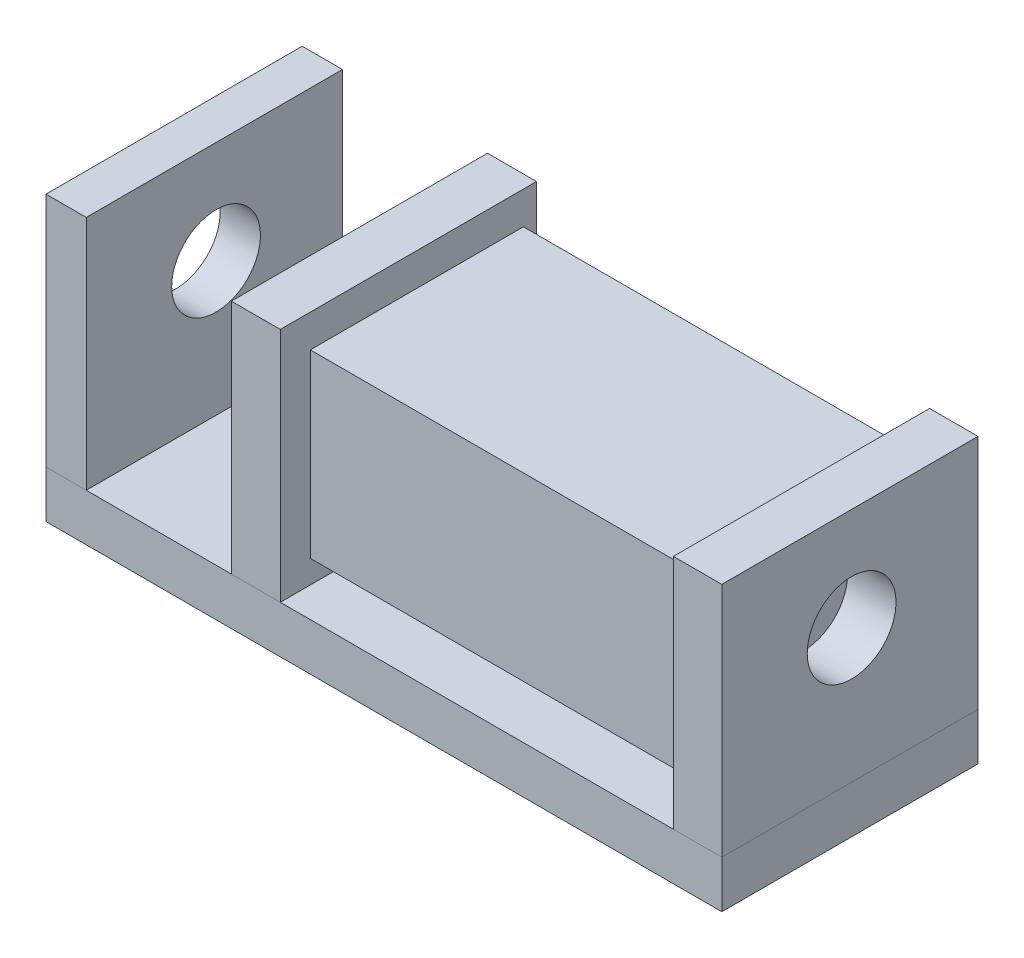
ISO-10303-21;
HEADER;
FILE_DESCRIPTION(('STEP AP214'),'2;1');
FILE_NAME('part.step','',(''),(''),'','','');
FILE_SCHEMA(('AUTOMOTIVE_DESIGN { 1 0 10303 214 1 1 1 1 }'));
ENDSEC;
DATA;
#1=APPLICATION_CONTEXT('core data for automotive mechanical design processes');
#2=APPLICATION_PROTOCOL_DEFINITION('international standard','automotive_design',2000,#1);
#3=PRODUCT_CONTEXT('',#1,'mechanical');
#4=PRODUCT('Part','Part','',(#3));
#5=PRODUCT_RELATED_PRODUCT_CATEGORY('part','',(#4));
#6=PRODUCT_DEFINITION_FORMATION('','',#4);
#7=PRODUCT_DEFINITION_CONTEXT('part definition',#1,'design');
#8=PRODUCT_DEFINITION('design','',#6,#7);
#9=PRODUCT_DEFINITION_SHAPE('','',#8);
#10=(LENGTH_UNIT() NAMED_UNIT(*) SI_UNIT(.MILLI.,.METRE.));
#11=(NAMED_UNIT(*) PLANE_ANGLE_UNIT() SI_UNIT($,.RADIAN.));
#12=(NAMED_UNIT(*) SI_UNIT($,.STERADIAN.) SOLID_ANGLE_UNIT());
#13=UNCERTAINTY_MEASURE_WITH_UNIT(LENGTH_MEASURE(1.E-05),#10,'distance_accuracy_value','');
#14=(GEOMETRIC_REPRESENTATION_CONTEXT(3) GLOBAL_UNCERTAINTY_ASSIGNED_CONTEXT((#13)) GLOBAL_UNIT_ASSIGNED_CONTEXT((#10,
#11,#12)) REPRESENTATION_CONTEXT('',''));
#15=CARTESIAN_POINT('',(0.,0.,0.));
#16=DIRECTION('',(0.,0.,1.));
#17=DIRECTION('',(1.,0.,0.));
#18=AXIS2_PLACEMENT_3D('',#15,#16,#17);
#19=CARTESIAN_POINT('',(132.746933466122,60.,0.));
#20=DIRECTION('',(1.,0.,0.));
#21=DIRECTION('',(0.,0.,-1.));
#22=AXIS2_PLACEMENT_3D('',#19,#20,#21);
#23=PLANE('',#22);
#24=DIRECTION('',(0.,-1.,0.));
#25=VECTOR('',#24,1.);
#26=CARTESIAN_POINT('',(132.746933466137,53.0819568307948,-6.34781427334019));
#27=LINE('',#26,#25);
#28=CARTESIAN_POINT('',(132.746933466137,53.0819568307948,-6.34781427334019));
#29=VERTEX_POINT('',#28);
#30=CARTESIAN_POINT('',(132.746933466137,14.8769483537876,-6.34781427334019));
#31=VERTEX_POINT('',#30);
#32=EDGE_CURVE('E49',#29,#31,#27,.T.);
#33=ORIENTED_EDGE('',*,*,#32,.T.);
#34=DIRECTION('',(0.,0.,-1.));
#35=VECTOR('',#34,1.);
#36=CARTESIAN_POINT('',(132.746933466137,14.8769483537876,-6.34781427334019));
#37=LINE('',#36,#35);
#38=CARTESIAN_POINT('',(132.746933466137,14.8769483537876,-51.4371231705013));
#39=VERTEX_POINT('',#38);
#40=EDGE_CURVE('E114',#31,#39,#37,.T.);
#41=ORIENTED_EDGE('',*,*,#40,.T.);
#42=DIRECTION('',(0.,1.,0.));
#43=VECTOR('',#42,1.);
#44=CARTESIAN_POINT('',(132.746933466137,53.0819568307948,-51.4371231705013));
#45=LINE('',#44,#43);
#46=CARTESIAN_POINT('',(132.746933466137,53.0819568307948,-51.4371231705013));
#47=VERTEX_POINT('',#46);
#48=EDGE_CURVE('E54',#39,#47,#45,.T.);
#49=ORIENTED_EDGE('',*,*,#48,.T.);
#50=DIRECTION('',(0.,0.,1.));
#51=VECTOR('',#50,1.);
#52=CARTESIAN_POINT('',(132.746933466137,53.0819568307948,-6.34781427334019));
#53=LINE('',#52,#51);
#54=EDGE_CURVE('E12',#47,#29,#53,.T.);
#55=ORIENTED_EDGE('',*,*,#54,.T.);
#56=EDGE_LOOP('',(#33,#41,#49,#55));
#57=FACE_BOUND('',#56,.T.);
#58=ADVANCED_FACE('F46',(#57),#23,.T.);
#59=CARTESIAN_POINT('',(500000.,14.8769483537876,-6.34781427334019));
#60=DIRECTION('',(0.,1.,0.));
#61=DIRECTION('',(0.,0.,1.));
#62=AXIS2_PLACEMENT_3D('',#59,#60,#61);
#63=PLANE('',#62);
#64=ORIENTED_EDGE('',*,*,#40,.F.);
#65=DIRECTION('',(-1.,0.,0.));
#66=VECTOR('',#65,1.);
#67=CARTESIAN_POINT('',(500000.,14.8769483537876,-6.34781427334019));
#68=LINE('',#67,#66);
#69=CARTESIAN_POINT('',(49.5738244185297,14.8769483537876,-6.34781427334019));
#70=VERTEX_POINT('',#69);
#71=EDGE_CURVE('E109',#31,#70,#68,.T.);
#72=ORIENTED_EDGE('',*,*,#71,.T.);
#73=DIRECTION('',(0.,0.,-1.));
#74=VECTOR('',#73,1.);
#75=CARTESIAN_POINT('',(49.5738244185297,14.8769483537876,-6.34781427334019));
#76=LINE('',#75,#74);
#77=CARTESIAN_POINT('',(49.5738244185297,14.8769483537876,-51.4371231705013));
#78=VERTEX_POINT('',#77);
#79=EDGE_CURVE('E104',#70,#78,#76,.T.);
#80=ORIENTED_EDGE('',*,*,#79,.T.);
#81=DIRECTION('',(-1.,0.,0.));
#82=VECTOR('',#81,1.);
#83=CARTESIAN_POINT('',(500000.,14.8769483537876,-51.4371231705013));
#84=LINE('',#83,#82);
#85=EDGE_CURVE('E111',#39,#78,#84,.T.);
#86=ORIENTED_EDGE('',*,*,#85,.F.);
#87=EDGE_LOOP('',(#64,#72,#80,#86));
#88=FACE_BOUND('',#87,.T.);
#89=ADVANCED_FACE('F118',(#88),#63,.F.);
#90=CARTESIAN_POINT('',(500000.,53.0819568307948,-6.34781427334019));
#91=DIRECTION('',(0.,0.,-1.));
#92=DIRECTION('',(-1.,0.,0.));
#93=AXIS2_PLACEMENT_3D('',#90,#91,#92);
#94=PLANE('',#93);
#95=ORIENTED_EDGE('',*,*,#32,.F.);
#96=DIRECTION('',(-1.,0.,0.));
#97=VECTOR('',#96,1.);
#98=CARTESIAN_POINT('',(500000.,53.0819568307948,-6.34781427334019));
#99=LINE('',#98,#97);
#100=CARTESIAN_POINT('',(49.5738244185297,53.0819568307948,-6.34781427334019));
#101=VERTEX_POINT('',#100);
#102=EDGE_CURVE('E84',#29,#101,#99,.T.);
#103=ORIENTED_EDGE('',*,*,#102,.T.);
#104=DIRECTION('',(0.,-1.,0.));
#105=VECTOR('',#104,1.);
#106=CARTESIAN_POINT('',(49.5738244185297,53.0819568307948,-6.34781427334019));
#107=LINE('',#106,#105);
#108=EDGE_CURVE('E89',#101,#70,#107,.T.);
#109=ORIENTED_EDGE('',*,*,#108,.T.);
#110=ORIENTED_EDGE('',*,*,#71,.F.);
#111=EDGE_LOOP('',(#95,#103,#109,#110));
#112=FACE_BOUND('',#111,.T.);
#113=ADVANCED_FACE('F86',(#112),#94,.F.);
#114=CARTESIAN_POINT('',(49.5738244185297,0.,0.));
#115=DIRECTION('',(1.,0.,0.));
#116=DIRECTION('',(0.,0.,-1.));
#117=AXIS2_PLACEMENT_3D('',#114,#115,#116);
#118=PLANE('',#117);
#119=ORIENTED_EDGE('',*,*,#108,.F.);
#120=DIRECTION('',(0.,0.,1.));
#121=VECTOR('',#120,1.);
#122=CARTESIAN_POINT('',(49.5738244185297,53.0819568307948,-6.34781427334019));
#123=LINE('',#122,#121);
#124=CARTESIAN_POINT('',(49.5738244185297,53.0819568307948,-51.4371231705013));
#125=VERTEX_POINT('',#124);
#126=EDGE_CURVE('E91',#125,#101,#123,.T.);
#127=ORIENTED_EDGE('',*,*,#126,.F.);
#128=DIRECTION('',(0.,1.,0.));
#129=VECTOR('',#128,1.);
#130=CARTESIAN_POINT('',(49.5738244185297,53.0819568307948,-51.4371231705013));
#131=LINE('',#130,#129);
#132=EDGE_CURVE('E99',#78,#125,#131,.T.);
#133=ORIENTED_EDGE('',*,*,#132,.F.);
#134=ORIENTED_EDGE('',*,*,#79,.F.);
#135=EDGE_LOOP('',(#119,#127,#133,#134));
#136=FACE_BOUND('',#135,.T.);
#137=ADVANCED_FACE('F102',(#136),#118,.F.);
#138=CARTESIAN_POINT('',(500000.,53.0819568307948,-51.4371231705013));
#139=DIRECTION('',(0.,0.,1.));
#140=DIRECTION('',(1.,0.,0.));
#141=AXIS2_PLACEMENT_3D('',#138,#139,#140);
#142=PLANE('',#141);
#143=ORIENTED_EDGE('',*,*,#48,.F.);
#144=ORIENTED_EDGE('',*,*,#85,.T.);
#145=ORIENTED_EDGE('',*,*,#132,.T.);
#146=DIRECTION('',(-1.,0.,0.));
#147=VECTOR('',#146,1.);
#148=CARTESIAN_POINT('',(500000.,53.0819568307948,-51.4371231705013));
#149=LINE('',#148,#147);
#150=EDGE_CURVE('E90',#47,#125,#149,.T.);
#151=ORIENTED_EDGE('',*,*,#150,.F.);
#152=EDGE_LOOP('',(#143,#144,#145,#151));
#153=FACE_BOUND('',#152,.T.);
#154=ADVANCED_FACE('F120',(#153),#142,.F.);
#155=CARTESIAN_POINT('',(500000.,53.0819568307948,-6.34781427334019));
#156=DIRECTION('',(0.,-1.,0.));
#157=DIRECTION('',(0.,0.,-1.));
#158=AXIS2_PLACEMENT_3D('',#155,#156,#157);
#159=PLANE('',#158);
#160=ORIENTED_EDGE('',*,*,#54,.F.);
#161=ORIENTED_EDGE('',*,*,#150,.T.);
#162=ORIENTED_EDGE('',*,*,#126,.T.);
#163=ORIENTED_EDGE('',*,*,#102,.F.);
#164=EDGE_LOOP('',(#160,#161,#162,#163));
#165=FACE_BOUND('',#164,.T.);
#166=ADVANCED_FACE('F94',(#165),#159,.F.);
#167=CLOSED_SHELL('',(#58,#89,#113,#137,#154,#166));
#168=MANIFOLD_SOLID_BREP('B2',#167);
#169=CARTESIAN_POINT('',(39.2104018854431,60.,-54.2064580712363));
#170=DIRECTION('',(1.,0.,0.));
#171=DIRECTION('',(0.,0.,-1.));
#172=AXIS2_PLACEMENT_3D('',#169,#170,#171);
#173=PLANE('',#172);
#174=CARTESIAN_POINT('',(39.2104018854431,38.2969215715457,-27.4639647561201));
#175=DIRECTION('',(1.,0.,0.));
#176=DIRECTION('',(0.,0.,-1.));
#177=AXIS2_PLACEMENT_3D('',#174,#175,#176);
#178=CIRCLE('',#177,9.39188455367871);
#179=CARTESIAN_POINT('',(39.2104018854431,38.2969215715457,-36.8558493097988));
#180=VERTEX_POINT('',#179);
#181=EDGE_CURVE('E248',#180,#180,#178,.T.);
#182=ORIENTED_EDGE('',*,*,#181,.T.);
#183=EDGE_LOOP('',(#182));
#184=FACE_BOUND('',#183,.T.);
#185=DIRECTION('',(0.,0.,1.));
#186=VECTOR('',#185,1.);
#187=CARTESIAN_POINT('',(39.2104018854431,10.,-54.2064580712363));
#188=LINE('',#187,#186);
#189=CARTESIAN_POINT('',(39.2104018854431,10.,-54.2064580712363));
#190=VERTEX_POINT('',#189);
#191=CARTESIAN_POINT('',(39.2104018854431,10.,0.));
#192=VERTEX_POINT('',#191);
#193=EDGE_CURVE('E245',#190,#192,#188,.T.);
#194=ORIENTED_EDGE('',*,*,#193,.T.);
#195=DIRECTION('',(0.,-1.,0.));
#196=VECTOR('',#195,1.);
#197=CARTESIAN_POINT('',(39.2104018854431,60.,0.));
#198=LINE('',#197,#196);
#199=CARTESIAN_POINT('',(39.2104018854431,60.,0.));
#200=VERTEX_POINT('',#199);
#201=EDGE_CURVE('E44',#200,#192,#198,.T.);
#202=ORIENTED_EDGE('',*,*,#201,.F.);
#203=DIRECTION('',(0.,0.,1.));
#204=VECTOR('',#203,1.);
#205=CARTESIAN_POINT('',(39.2104018854431,60.,-54.2064580712363));
#206=LINE('',#205,#204);
#207=CARTESIAN_POINT('',(39.2104018854431,60.,-54.2064580712363));
#208=VERTEX_POINT('',#207);
#209=EDGE_CURVE('E232',#208,#200,#206,.T.);
#210=ORIENTED_EDGE('',*,*,#209,.F.);
#211=DIRECTION('',(0.,-1.,0.));
#212=VECTOR('',#211,1.);
#213=CARTESIAN_POINT('',(39.2104018854431,60.,-54.2064580712363));
#214=LINE('',#213,#212);
#215=EDGE_CURVE('E241',#208,#190,#214,.T.);
#216=ORIENTED_EDGE('',*,*,#215,.T.);
#217=EDGE_LOOP('',(#194,#202,#210,#216));
#218=FACE_BOUND('',#217,.T.);
#219=ADVANCED_FACE('F180',(#184,#218),#173,.F.);
#220=CARTESIAN_POINT('',(39.2104018854431,60.,0.));
#221=DIRECTION('',(0.,0.,-1.));
#222=DIRECTION('',(-1.,0.,0.));
#223=AXIS2_PLACEMENT_3D('',#220,#221,#222);
#224=PLANE('',#223);
#225=DIRECTION('',(1.,0.,0.));
#226=VECTOR('',#225,1.);
#227=CARTESIAN_POINT('',(39.2104018854431,10.,0.));
#228=LINE('',#227,#226);
#229=CARTESIAN_POINT('',(49.5738244185297,10.,0.));
#230=VERTEX_POINT('',#229);
#231=EDGE_CURVE('E236',#192,#230,#228,.T.);
#232=ORIENTED_EDGE('',*,*,#231,.T.);
#233=DIRECTION('',(0.,-1.,0.));
#234=VECTOR('',#233,1.);
#235=CARTESIAN_POINT('',(49.5738244185297,60.,0.));
#236=LINE('',#235,#234);
#237=CARTESIAN_POINT('',(49.5738244185297,60.,0.));
#238=VERTEX_POINT('',#237);
#239=EDGE_CURVE('E189',#238,#230,#236,.T.);
#240=ORIENTED_EDGE('',*,*,#239,.F.);
#241=DIRECTION('',(1.,0.,0.));
#242=VECTOR('',#241,1.);
#243=CARTESIAN_POINT('',(39.2104018854431,60.,0.));
#244=LINE('',#243,#242);
#245=EDGE_CURVE('E227',#200,#238,#244,.T.);
#246=ORIENTED_EDGE('',*,*,#245,.F.);
#247=ORIENTED_EDGE('',*,*,#201,.T.);
#248=EDGE_LOOP('',(#232,#240,#246,#247));
#249=FACE_BOUND('',#248,.T.);
#250=ADVANCED_FACE('F235',(#249),#224,.F.);
#251=CARTESIAN_POINT('',(49.5738244185297,60.,-54.2064580712363));
#252=DIRECTION('',(-1.,0.,0.));
#253=DIRECTION('',(0.,0.,1.));
#254=AXIS2_PLACEMENT_3D('',#251,#252,#253);
#255=PLANE('',#254);
#256=CARTESIAN_POINT('',(49.5738244185297,38.2969215715457,-27.4639647561201));
#257=DIRECTION('',(-1.,0.,0.));
#258=DIRECTION('',(0.,0.,1.));
#259=AXIS2_PLACEMENT_3D('',#256,#257,#258);
#260=CIRCLE('',#259,9.39188455367871);
#261=CARTESIAN_POINT('',(49.5738244185297,38.2969215715457,-18.0720802024414));
#262=VERTEX_POINT('',#261);
#263=EDGE_CURVE('E183',#262,#262,#260,.T.);
#264=ORIENTED_EDGE('',*,*,#263,.T.);
#265=EDGE_LOOP('',(#264));
#266=FACE_BOUND('',#265,.T.);
#267=DIRECTION('',(0.,0.,-1.));
#268=VECTOR('',#267,1.);
#269=CARTESIAN_POINT('',(49.5738244185297,10.,-54.2064580712363));
#270=LINE('',#269,#268);
#271=CARTESIAN_POINT('',(49.5738244185297,10.,-54.2064580712363));
#272=VERTEX_POINT('',#271);
#273=EDGE_CURVE('E214',#230,#272,#270,.T.);
#274=ORIENTED_EDGE('',*,*,#273,.T.);
#275=DIRECTION('',(0.,-1.,0.));
#276=VECTOR('',#275,1.);
#277=CARTESIAN_POINT('',(49.5738244185297,60.,-54.2064580712363));
#278=LINE('',#277,#276);
#279=CARTESIAN_POINT('',(49.5738244185297,60.,-54.2064580712363));
#280=VERTEX_POINT('',#279);
#281=EDGE_CURVE('E237',#280,#272,#278,.T.);
#282=ORIENTED_EDGE('',*,*,#281,.F.);
#283=DIRECTION('',(0.,0.,-1.));
#284=VECTOR('',#283,1.);
#285=CARTESIAN_POINT('',(49.5738244185297,60.,-54.2064580712363));
#286=LINE('',#285,#284);
#287=EDGE_CURVE('E230',#238,#280,#286,.T.);
#288=ORIENTED_EDGE('',*,*,#287,.F.);
#289=ORIENTED_EDGE('',*,*,#239,.T.);
#290=EDGE_LOOP('',(#274,#282,#288,#289));
#291=FACE_BOUND('',#290,.T.);
#292=ADVANCED_FACE('F239',(#266,#291),#255,.F.);
#293=CARTESIAN_POINT('',(39.2104018854431,60.,-54.2064580712363));
#294=DIRECTION('',(0.,0.,1.));
#295=DIRECTION('',(1.,0.,0.));
#296=AXIS2_PLACEMENT_3D('',#293,#294,#295);
#297=PLANE('',#296);
#298=DIRECTION('',(-1.,0.,0.));
#299=VECTOR('',#298,1.);
#300=CARTESIAN_POINT('',(39.2104018854431,10.,-54.2064580712363));
#301=LINE('',#300,#299);
#302=EDGE_CURVE('E220',#272,#190,#301,.T.);
#303=ORIENTED_EDGE('',*,*,#302,.T.);
#304=ORIENTED_EDGE('',*,*,#215,.F.);
#305=DIRECTION('',(-1.,0.,0.));
#306=VECTOR('',#305,1.);
#307=CARTESIAN_POINT('',(39.2104018854431,60.,-54.2064580712363));
#308=LINE('',#307,#306);
#309=EDGE_CURVE('E197',#280,#208,#308,.T.);
#310=ORIENTED_EDGE('',*,*,#309,.F.);
#311=ORIENTED_EDGE('',*,*,#281,.T.);
#312=EDGE_LOOP('',(#303,#304,#310,#311));
#313=FACE_BOUND('',#312,.T.);
#314=ADVANCED_FACE('F253',(#313),#297,.F.);
#315=CARTESIAN_POINT('',(0.,60.,0.));
#316=DIRECTION('',(0.,1.,0.));
#317=DIRECTION('',(0.,0.,1.));
#318=AXIS2_PLACEMENT_3D('',#315,#316,#317);
#319=PLANE('',#318);
#320=ORIENTED_EDGE('',*,*,#209,.T.);
#321=ORIENTED_EDGE('',*,*,#245,.T.);
#322=ORIENTED_EDGE('',*,*,#287,.T.);
#323=ORIENTED_EDGE('',*,*,#309,.T.);
#324=EDGE_LOOP('',(#320,#321,#322,#323));
#325=FACE_BOUND('',#324,.T.);
#326=ADVANCED_FACE('F228',(#325),#319,.T.);
#327=CARTESIAN_POINT('',(0.,10.,0.));
#328=DIRECTION('',(0.,1.,0.));
#329=DIRECTION('',(0.,0.,1.));
#330=AXIS2_PLACEMENT_3D('',#327,#328,#329);
#331=PLANE('',#330);
#332=ORIENTED_EDGE('',*,*,#193,.F.);
#333=ORIENTED_EDGE('',*,*,#302,.F.);
#334=ORIENTED_EDGE('',*,*,#273,.F.);
#335=ORIENTED_EDGE('',*,*,#231,.F.);
#336=EDGE_LOOP('',(#332,#333,#334,#335));
#337=FACE_BOUND('',#336,.T.);
#338=ADVANCED_FACE('F256',(#337),#331,.F.);
#339=CARTESIAN_POINT('',(169.557159039612,38.2969215715457,-27.4639647561201));
#340=DIRECTION('',(-1.,0.,0.));
#341=DIRECTION('',(0.,0.,1.));
#342=AXIS2_PLACEMENT_3D('',#339,#340,#341);
#343=CYLINDRICAL_SURFACE('',#342,9.39188455367871);
#344=ORIENTED_EDGE('',*,*,#263,.F.);
#345=EDGE_LOOP('',(#344));
#346=FACE_BOUND('',#345,.T.);
#347=ORIENTED_EDGE('',*,*,#181,.F.);
#348=EDGE_LOOP('',(#347));
#349=FACE_BOUND('',#348,.T.);
#350=ADVANCED_FACE('F266',(#346,#349),#343,.F.);
#351=CLOSED_SHELL('',(#219,#250,#292,#314,#326,#338,#350));
#352=MANIFOLD_SOLID_BREP('B6',#351);
#353=CARTESIAN_POINT('',(142.992898015503,60.,0.));
#354=DIRECTION('',(-1.,0.,0.));
#355=DIRECTION('',(0.,0.,1.));
#356=AXIS2_PLACEMENT_3D('',#353,#354,#355);
#357=PLANE('',#356);
#358=CARTESIAN_POINT('',(142.992898015503,38.2969215715457,-27.4639647561201));
#359=DIRECTION('',(-1.,0.,0.));
#360=DIRECTION('',(0.,0.,1.));
#361=AXIS2_PLACEMENT_3D('',#358,#359,#360);
#362=CIRCLE('',#361,9.39188455367871);
#363=CARTESIAN_POINT('',(142.992898015503,38.2969215715457,-18.0720802024414));
#364=VERTEX_POINT('',#363);
#365=EDGE_CURVE('E413',#364,#364,#362,.F.);
#366=ORIENTED_EDGE('',*,*,#365,.F.);
#367=EDGE_LOOP('',(#366));
#368=FACE_BOUND('',#367,.T.);
#369=DIRECTION('',(0.,0.,-1.));
#370=VECTOR('',#369,1.);
#371=CARTESIAN_POINT('',(142.992898015503,10.,0.));
#372=LINE('',#371,#370);
#373=CARTESIAN_POINT('',(142.992898015503,10.,0.));
#374=VERTEX_POINT('',#373);
#375=CARTESIAN_POINT('',(142.992898015503,10.,-54.2064580712363));
#376=VERTEX_POINT('',#375);
#377=EDGE_CURVE('E400',#374,#376,#372,.T.);
#378=ORIENTED_EDGE('',*,*,#377,.T.);
#379=DIRECTION('',(0.,-1.,0.));
#380=VECTOR('',#379,1.);
#381=CARTESIAN_POINT('',(142.992898015503,60.,-54.2064580712363));
#382=LINE('',#381,#380);
#383=CARTESIAN_POINT('',(142.992898015503,60.,-54.2064580712363));
#384=VERTEX_POINT('',#383);
#385=EDGE_CURVE('E178',#384,#376,#382,.T.);
#386=ORIENTED_EDGE('',*,*,#385,.F.);
#387=DIRECTION('',(0.,0.,-1.));
#388=VECTOR('',#387,1.);
#389=CARTESIAN_POINT('',(142.992898015503,60.,0.));
#390=LINE('',#389,#388);
#391=CARTESIAN_POINT('',(142.992898015503,60.,0.));
#392=VERTEX_POINT('',#391);
#393=EDGE_CURVE('E387',#392,#384,#390,.T.);
#394=ORIENTED_EDGE('',*,*,#393,.F.);
#395=DIRECTION('',(0.,-1.,0.));
#396=VECTOR('',#395,1.);
#397=CARTESIAN_POINT('',(142.992898015503,60.,0.));
#398=LINE('',#397,#396);
#399=EDGE_CURVE('E396',#392,#374,#398,.T.);
#400=ORIENTED_EDGE('',*,*,#399,.T.);
#401=EDGE_LOOP('',(#378,#386,#394,#400));
#402=FACE_BOUND('',#401,.T.);
#403=ADVANCED_FACE('F335',(#368,#402),#357,.F.);
#404=CARTESIAN_POINT('',(142.992898015503,60.,-54.2064580712363));
#405=DIRECTION('',(0.,0.,1.));
#406=DIRECTION('',(1.,0.,0.));
#407=AXIS2_PLACEMENT_3D('',#404,#405,#406);
#408=PLANE('',#407);
#409=DIRECTION('',(-1.,0.,0.));
#410=VECTOR('',#409,1.);
#411=CARTESIAN_POINT('',(142.992898015503,10.,-54.2064580712363));
#412=LINE('',#411,#410);
#413=CARTESIAN_POINT('',(132.746933466122,10.,-54.2064580712363));
#414=VERTEX_POINT('',#413);
#415=EDGE_CURVE('E391',#376,#414,#412,.T.);
#416=ORIENTED_EDGE('',*,*,#415,.T.);
#417=DIRECTION('',(0.,-1.,0.));
#418=VECTOR('',#417,1.);
#419=CARTESIAN_POINT('',(132.746933466122,60.,-54.2064580712363));
#420=LINE('',#419,#418);
#421=CARTESIAN_POINT('',(132.746933466122,60.,-54.2064580712363));
#422=VERTEX_POINT('',#421);
#423=EDGE_CURVE('E344',#422,#414,#420,.T.);
#424=ORIENTED_EDGE('',*,*,#423,.F.);
#425=DIRECTION('',(-1.,0.,0.));
#426=VECTOR('',#425,1.);
#427=CARTESIAN_POINT('',(142.992898015503,60.,-54.2064580712363));
#428=LINE('',#427,#426);
#429=EDGE_CURVE('E382',#384,#422,#428,.T.);
#430=ORIENTED_EDGE('',*,*,#429,.F.);
#431=ORIENTED_EDGE('',*,*,#385,.T.);
#432=EDGE_LOOP('',(#416,#424,#430,#431));
#433=FACE_BOUND('',#432,.T.);
#434=ADVANCED_FACE('F390',(#433),#408,.F.);
#435=CARTESIAN_POINT('',(132.746933466122,60.,0.));
#436=DIRECTION('',(1.,0.,0.));
#437=DIRECTION('',(0.,0.,-1.));
#438=AXIS2_PLACEMENT_3D('',#435,#436,#437);
#439=PLANE('',#438);
#440=CARTESIAN_POINT('',(132.746933466122,38.2969215715457,-27.4639647561201));
#441=DIRECTION('',(1.,0.,0.));
#442=DIRECTION('',(0.,0.,-1.));
#443=AXIS2_PLACEMENT_3D('',#440,#441,#442);
#444=CIRCLE('',#443,9.39188455367871);
#445=CARTESIAN_POINT('',(132.746933466122,38.2969215715457,-36.8558493097988));
#446=VERTEX_POINT('',#445);
#447=EDGE_CURVE('E338',#446,#446,#444,.T.);
#448=ORIENTED_EDGE('',*,*,#447,.T.);
#449=EDGE_LOOP('',(#448));
#450=FACE_BOUND('',#449,.T.);
#451=DIRECTION('',(0.,0.,1.));
#452=VECTOR('',#451,1.);
#453=CARTESIAN_POINT('',(132.746933466122,10.,0.));
#454=LINE('',#453,#452);
#455=CARTESIAN_POINT('',(132.746933466122,10.,0.));
#456=VERTEX_POINT('',#455);
#457=EDGE_CURVE('E369',#414,#456,#454,.T.);
#458=ORIENTED_EDGE('',*,*,#457,.T.);
#459=DIRECTION('',(0.,-1.,0.));
#460=VECTOR('',#459,1.);
#461=CARTESIAN_POINT('',(132.746933466122,60.,0.));
#462=LINE('',#461,#460);
#463=CARTESIAN_POINT('',(132.746933466122,60.,0.));
#464=VERTEX_POINT('',#463);
#465=EDGE_CURVE('E392',#464,#456,#462,.T.);
#466=ORIENTED_EDGE('',*,*,#465,.F.);
#467=DIRECTION('',(0.,0.,1.));
#468=VECTOR('',#467,1.);
#469=CARTESIAN_POINT('',(132.746933466122,60.,0.));
#470=LINE('',#469,#468);
#471=EDGE_CURVE('E385',#422,#464,#470,.T.);
#472=ORIENTED_EDGE('',*,*,#471,.F.);
#473=ORIENTED_EDGE('',*,*,#423,.T.);
#474=EDGE_LOOP('',(#458,#466,#472,#473));
#475=FACE_BOUND('',#474,.T.);
#476=ADVANCED_FACE('F394',(#450,#475),#439,.F.);
#477=CARTESIAN_POINT('',(142.992898015503,60.,0.));
#478=DIRECTION('',(0.,0.,-1.));
#479=DIRECTION('',(-1.,0.,0.));
#480=AXIS2_PLACEMENT_3D('',#477,#478,#479);
#481=PLANE('',#480);
#482=DIRECTION('',(1.,0.,0.));
#483=VECTOR('',#482,1.);
#484=CARTESIAN_POINT('',(142.992898015503,10.,0.));
#485=LINE('',#484,#483);
#486=EDGE_CURVE('E375',#456,#374,#485,.T.);
#487=ORIENTED_EDGE('',*,*,#486,.T.);
#488=ORIENTED_EDGE('',*,*,#399,.F.);
#489=DIRECTION('',(1.,0.,0.));
#490=VECTOR('',#489,1.);
#491=CARTESIAN_POINT('',(142.992898015503,60.,0.));
#492=LINE('',#491,#490);
#493=EDGE_CURVE('E352',#464,#392,#492,.T.);
#494=ORIENTED_EDGE('',*,*,#493,.F.);
#495=ORIENTED_EDGE('',*,*,#465,.T.);
#496=EDGE_LOOP('',(#487,#488,#494,#495));
#497=FACE_BOUND('',#496,.T.);
#498=ADVANCED_FACE('F407',(#497),#481,.F.);
#499=CARTESIAN_POINT('',(0.,60.,0.));
#500=DIRECTION('',(0.,1.,0.));
#501=DIRECTION('',(0.,0.,1.));
#502=AXIS2_PLACEMENT_3D('',#499,#500,#501);
#503=PLANE('',#502);
#504=ORIENTED_EDGE('',*,*,#393,.T.);
#505=ORIENTED_EDGE('',*,*,#429,.T.);
#506=ORIENTED_EDGE('',*,*,#471,.T.);
#507=ORIENTED_EDGE('',*,*,#493,.T.);
#508=EDGE_LOOP('',(#504,#505,#506,#507));
#509=FACE_BOUND('',#508,.T.);
#510=ADVANCED_FACE('F383',(#509),#503,.T.);
#511=CARTESIAN_POINT('',(0.,10.,0.));
#512=DIRECTION('',(0.,1.,0.));
#513=DIRECTION('',(0.,0.,1.));
#514=AXIS2_PLACEMENT_3D('',#511,#512,#513);
#515=PLANE('',#514);
#516=ORIENTED_EDGE('',*,*,#377,.F.);
#517=ORIENTED_EDGE('',*,*,#486,.F.);
#518=ORIENTED_EDGE('',*,*,#457,.F.);
#519=ORIENTED_EDGE('',*,*,#415,.F.);
#520=EDGE_LOOP('',(#516,#517,#518,#519));
#521=FACE_BOUND('',#520,.T.);
#522=ADVANCED_FACE('F410',(#521),#515,.F.);
#523=CARTESIAN_POINT('',(169.557159039612,38.2969215715457,-27.4639647561201));
#524=DIRECTION('',(-1.,0.,0.));
#525=DIRECTION('',(0.,0.,1.));
#526=AXIS2_PLACEMENT_3D('',#523,#524,#525);
#527=CYLINDRICAL_SURFACE('',#526,9.39188455367871);
#528=ORIENTED_EDGE('',*,*,#365,.T.);
#529=EDGE_LOOP('',(#528));
#530=FACE_BOUND('',#529,.T.);
#531=ORIENTED_EDGE('',*,*,#447,.F.);
#532=EDGE_LOOP('',(#531));
#533=FACE_BOUND('',#532,.T.);
#534=ADVANCED_FACE('F421',(#530,#533),#527,.F.);
#535=CLOSED_SHELL('',(#403,#434,#476,#498,#510,#522,#534));
#536=MANIFOLD_SOLID_BREP('B38',#535);
#537=CARTESIAN_POINT('',(0.,60.,0.));
#538=DIRECTION('',(1.,0.,0.));
#539=DIRECTION('',(0.,0.,-1.));
#540=AXIS2_PLACEMENT_3D('',#537,#538,#539);
#541=PLANE('',#540);
#542=CARTESIAN_POINT('',(0.,38.2969215715457,-27.4639647561201));
#543=DIRECTION('',(-1.,0.,0.));
#544=DIRECTION('',(0.,0.,1.));
#545=AXIS2_PLACEMENT_3D('',#542,#543,#544);
#546=CIRCLE('',#545,9.39188455367871);
#547=CARTESIAN_POINT('',(0.,38.2969215715457,-18.0720802024414));
#548=VERTEX_POINT('',#547);
#549=EDGE_CURVE('E567',#548,#548,#546,.T.);
#550=ORIENTED_EDGE('',*,*,#549,.F.);
#551=EDGE_LOOP('',(#550));
#552=FACE_BOUND('',#551,.T.);
#553=DIRECTION('',(0.,0.,1.));
#554=VECTOR('',#553,1.);
#555=CARTESIAN_POINT('',(0.,10.,0.));
#556=LINE('',#555,#554);
#557=CARTESIAN_POINT('',(0.,10.,-54.2064580712363));
#558=VERTEX_POINT('',#557);
#559=CARTESIAN_POINT('',(0.,10.,0.));
#560=VERTEX_POINT('',#559);
#561=EDGE_CURVE('E554',#558,#560,#556,.T.);
#562=ORIENTED_EDGE('',*,*,#561,.T.);
#563=DIRECTION('',(0.,-1.,0.));
#564=VECTOR('',#563,1.);
#565=CARTESIAN_POINT('',(0.,60.,0.));
#566=LINE('',#565,#564);
#567=CARTESIAN_POINT('',(0.,60.,0.));
#568=VERTEX_POINT('',#567);
#569=EDGE_CURVE('E333',#568,#560,#566,.T.);
#570=ORIENTED_EDGE('',*,*,#569,.F.);
#571=DIRECTION('',(0.,0.,1.));
#572=VECTOR('',#571,1.);
#573=CARTESIAN_POINT('',(0.,60.,0.));
#574=LINE('',#573,#572);
#575=CARTESIAN_POINT('',(0.,60.,-54.2064580712363));
#576=VERTEX_POINT('',#575);
#577=EDGE_CURVE('E541',#576,#568,#574,.T.);
#578=ORIENTED_EDGE('',*,*,#577,.F.);
#579=DIRECTION('',(0.,-1.,0.));
#580=VECTOR('',#579,1.);
#581=CARTESIAN_POINT('',(0.,60.,-54.2064580712363));
#582=LINE('',#581,#580);
#583=EDGE_CURVE('E550',#576,#558,#582,.T.);
#584=ORIENTED_EDGE('',*,*,#583,.T.);
#585=EDGE_LOOP('',(#562,#570,#578,#584));
#586=FACE_BOUND('',#585,.T.);
#587=ADVANCED_FACE('F489',(#552,#586),#541,.F.);
#588=CARTESIAN_POINT('',(0.,60.,0.));
#589=DIRECTION('',(0.,0.,-1.));
#590=DIRECTION('',(-1.,0.,0.));
#591=AXIS2_PLACEMENT_3D('',#588,#589,#590);
#592=PLANE('',#591);
#593=DIRECTION('',(1.,0.,0.));
#594=VECTOR('',#593,1.);
#595=CARTESIAN_POINT('',(0.,10.,0.));
#596=LINE('',#595,#594);
#597=CARTESIAN_POINT('',(8.51872746053289,10.,0.));
#598=VERTEX_POINT('',#597);
#599=EDGE_CURVE('E545',#560,#598,#596,.T.);
#600=ORIENTED_EDGE('',*,*,#599,.T.);
#601=DIRECTION('',(0.,-1.,0.));
#602=VECTOR('',#601,1.);
#603=CARTESIAN_POINT('',(8.51872746053289,60.,0.));
#604=LINE('',#603,#602);
#605=CARTESIAN_POINT('',(8.51872746053289,60.,0.));
#606=VERTEX_POINT('',#605);
#607=EDGE_CURVE('E498',#606,#598,#604,.T.);
#608=ORIENTED_EDGE('',*,*,#607,.F.);
#609=DIRECTION('',(1.,0.,0.));
#610=VECTOR('',#609,1.);
#611=CARTESIAN_POINT('',(0.,60.,0.));
#612=LINE('',#611,#610);
#613=EDGE_CURVE('E536',#568,#606,#612,.T.);
#614=ORIENTED_EDGE('',*,*,#613,.F.);
#615=ORIENTED_EDGE('',*,*,#569,.T.);
#616=EDGE_LOOP('',(#600,#608,#614,#615));
#617=FACE_BOUND('',#616,.T.);
#618=ADVANCED_FACE('F544',(#617),#592,.F.);
#619=CARTESIAN_POINT('',(8.51872746053289,60.,0.));
#620=DIRECTION('',(-1.,0.,0.));
#621=DIRECTION('',(0.,0.,1.));
#622=AXIS2_PLACEMENT_3D('',#619,#620,#621);
#623=PLANE('',#622);
#624=CARTESIAN_POINT('',(8.51872746053289,38.2969215715457,-27.4639647561201));
#625=DIRECTION('',(-1.,0.,0.));
#626=DIRECTION('',(0.,0.,1.));
#627=AXIS2_PLACEMENT_3D('',#624,#625,#626);
#628=CIRCLE('',#627,9.39188455367871);
#629=CARTESIAN_POINT('',(8.51872746053289,38.2969215715457,-18.0720802024414));
#630=VERTEX_POINT('',#629);
#631=EDGE_CURVE('E492',#630,#630,#628,.T.);
#632=ORIENTED_EDGE('',*,*,#631,.T.);
#633=EDGE_LOOP('',(#632));
#634=FACE_BOUND('',#633,.T.);
#635=DIRECTION('',(0.,0.,-1.));
#636=VECTOR('',#635,1.);
#637=CARTESIAN_POINT('',(8.51872746053289,10.,0.));
#638=LINE('',#637,#636);
#639=CARTESIAN_POINT('',(8.51872746053289,10.,-54.2064580712363));
#640=VERTEX_POINT('',#639);
#641=EDGE_CURVE('E523',#598,#640,#638,.T.);
#642=ORIENTED_EDGE('',*,*,#641,.T.);
#643=DIRECTION('',(0.,-1.,0.));
#644=VECTOR('',#643,1.);
#645=CARTESIAN_POINT('',(8.51872746053289,60.,-54.2064580712363));
#646=LINE('',#645,#644);
#647=CARTESIAN_POINT('',(8.51872746053289,60.,-54.2064580712363));
#648=VERTEX_POINT('',#647);
#649=EDGE_CURVE('E546',#648,#640,#646,.T.);
#650=ORIENTED_EDGE('',*,*,#649,.F.);
#651=DIRECTION('',(0.,0.,-1.));
#652=VECTOR('',#651,1.);
#653=CARTESIAN_POINT('',(8.51872746053289,60.,0.));
#654=LINE('',#653,#652);
#655=EDGE_CURVE('E539',#606,#648,#654,.T.);
#656=ORIENTED_EDGE('',*,*,#655,.F.);
#657=ORIENTED_EDGE('',*,*,#607,.T.);
#658=EDGE_LOOP('',(#642,#650,#656,#657));
#659=FACE_BOUND('',#658,.T.);
#660=ADVANCED_FACE('F548',(#634,#659),#623,.F.);
#661=CARTESIAN_POINT('',(0.,60.,-54.2064580712363));
#662=DIRECTION('',(0.,0.,1.));
#663=DIRECTION('',(1.,0.,0.));
#664=AXIS2_PLACEMENT_3D('',#661,#662,#663);
#665=PLANE('',#664);
#666=DIRECTION('',(-1.,0.,0.));
#667=VECTOR('',#666,1.);
#668=CARTESIAN_POINT('',(0.,10.,-54.2064580712363));
#669=LINE('',#668,#667);
#670=EDGE_CURVE('E529',#640,#558,#669,.T.);
#671=ORIENTED_EDGE('',*,*,#670,.T.);
#672=ORIENTED_EDGE('',*,*,#583,.F.);
#673=DIRECTION('',(-1.,0.,0.));
#674=VECTOR('',#673,1.);
#675=CARTESIAN_POINT('',(0.,60.,-54.2064580712363));
#676=LINE('',#675,#674);
#677=EDGE_CURVE('E506',#648,#576,#676,.T.);
#678=ORIENTED_EDGE('',*,*,#677,.F.);
#679=ORIENTED_EDGE('',*,*,#649,.T.);
#680=EDGE_LOOP('',(#671,#672,#678,#679));
#681=FACE_BOUND('',#680,.T.);
#682=ADVANCED_FACE('F561',(#681),#665,.F.);
#683=CARTESIAN_POINT('',(0.,60.,0.));
#684=DIRECTION('',(0.,-1.,0.));
#685=DIRECTION('',(0.,0.,-1.));
#686=AXIS2_PLACEMENT_3D('',#683,#684,#685);
#687=PLANE('',#686);
#688=ORIENTED_EDGE('',*,*,#577,.T.);
#689=ORIENTED_EDGE('',*,*,#613,.T.);
#690=ORIENTED_EDGE('',*,*,#655,.T.);
#691=ORIENTED_EDGE('',*,*,#677,.T.);
#692=EDGE_LOOP('',(#688,#689,#690,#691));
#693=FACE_BOUND('',#692,.T.);
#694=ADVANCED_FACE('F537',(#693),#687,.F.);
#695=CARTESIAN_POINT('',(0.,10.,0.));
#696=DIRECTION('',(0.,-1.,0.));
#697=DIRECTION('',(0.,0.,-1.));
#698=AXIS2_PLACEMENT_3D('',#695,#696,#697);
#699=PLANE('',#698);
#700=ORIENTED_EDGE('',*,*,#561,.F.);
#701=ORIENTED_EDGE('',*,*,#670,.F.);
#702=ORIENTED_EDGE('',*,*,#641,.F.);
#703=ORIENTED_EDGE('',*,*,#599,.F.);
#704=EDGE_LOOP('',(#700,#701,#702,#703));
#705=FACE_BOUND('',#704,.T.);
#706=ADVANCED_FACE('F564',(#705),#699,.T.);
#707=CARTESIAN_POINT('',(169.557159039612,38.2969215715457,-27.4639647561201));
#708=DIRECTION('',(-1.,0.,0.));
#709=DIRECTION('',(0.,0.,1.));
#710=AXIS2_PLACEMENT_3D('',#707,#708,#709);
#711=CYLINDRICAL_SURFACE('',#710,9.39188455367871);
#712=ORIENTED_EDGE('',*,*,#549,.T.);
#713=EDGE_LOOP('',(#712));
#714=FACE_BOUND('',#713,.T.);
#715=ORIENTED_EDGE('',*,*,#631,.F.);
#716=EDGE_LOOP('',(#715));
#717=FACE_BOUND('',#716,.T.);
#718=ADVANCED_FACE('F575',(#714,#717),#711,.F.);
#719=CLOSED_SHELL('',(#587,#618,#660,#682,#694,#706,#718));
#720=MANIFOLD_SOLID_BREP('B172',#719);
#721=CARTESIAN_POINT('',(0.,10.,0.));
#722=DIRECTION('',(1.,0.,0.));
#723=DIRECTION('',(0.,0.,-1.));
#724=AXIS2_PLACEMENT_3D('',#721,#722,#723);
#725=PLANE('',#724);
#726=DIRECTION('',(0.,0.,1.));
#727=VECTOR('',#726,1.);
#728=CARTESIAN_POINT('',(0.,0.,0.));
#729=LINE('',#728,#727);
#730=CARTESIAN_POINT('',(0.,0.,-54.2064580712363));
#731=VERTEX_POINT('',#730);
#732=CARTESIAN_POINT('',(0.,0.,0.));
#733=VERTEX_POINT('',#732);
#734=EDGE_CURVE('E697',#731,#733,#729,.T.);
#735=ORIENTED_EDGE('',*,*,#734,.T.);
#736=DIRECTION('',(0.,-1.,0.));
#737=VECTOR('',#736,1.);
#738=CARTESIAN_POINT('',(0.,10.,0.));
#739=LINE('',#738,#737);
#740=CARTESIAN_POINT('',(0.,10.,0.));
#741=VERTEX_POINT('',#740);
#742=EDGE_CURVE('E487',#741,#733,#739,.T.);
#743=ORIENTED_EDGE('',*,*,#742,.F.);
#744=DIRECTION('',(0.,0.,1.));
#745=VECTOR('',#744,1.);
#746=CARTESIAN_POINT('',(0.,10.,0.));
#747=LINE('',#746,#745);
#748=CARTESIAN_POINT('',(0.,10.,-54.2064580712363));
#749=VERTEX_POINT('',#748);
#750=EDGE_CURVE('E685',#749,#741,#747,.T.);
#751=ORIENTED_EDGE('',*,*,#750,.F.);
#752=DIRECTION('',(0.,-1.,0.));
#753=VECTOR('',#752,1.);
#754=CARTESIAN_POINT('',(0.,10.,-54.2064580712363));
#755=LINE('',#754,#753);
#756=EDGE_CURVE('E693',#749,#731,#755,.T.);
#757=ORIENTED_EDGE('',*,*,#756,.T.);
#758=EDGE_LOOP('',(#735,#743,#751,#757));
#759=FACE_BOUND('',#758,.T.);
#760=ADVANCED_FACE('F634',(#759),#725,.F.);
#761=CARTESIAN_POINT('',(0.,10.,0.));
#762=DIRECTION('',(0.,0.,-1.));
#763=DIRECTION('',(-1.,0.,0.));
#764=AXIS2_PLACEMENT_3D('',#761,#762,#763);
#765=PLANE('',#764);
#766=DIRECTION('',(1.,0.,0.));
#767=VECTOR('',#766,1.);
#768=CARTESIAN_POINT('',(0.,0.,0.));
#769=LINE('',#768,#767);
#770=CARTESIAN_POINT('',(142.992898015503,0.,0.));
#771=VERTEX_POINT('',#770);
#772=EDGE_CURVE('E689',#733,#771,#769,.T.);
#773=ORIENTED_EDGE('',*,*,#772,.T.);
#774=DIRECTION('',(0.,-1.,0.));
#775=VECTOR('',#774,1.);
#776=CARTESIAN_POINT('',(142.992898015503,10.,0.));
#777=LINE('',#776,#775);
#778=CARTESIAN_POINT('',(142.992898015503,10.,0.));
#779=VERTEX_POINT('',#778);
#780=EDGE_CURVE('E642',#779,#771,#777,.T.);
#781=ORIENTED_EDGE('',*,*,#780,.F.);
#782=DIRECTION('',(1.,0.,0.));
#783=VECTOR('',#782,1.);
#784=CARTESIAN_POINT('',(0.,10.,0.));
#785=LINE('',#784,#783);
#786=EDGE_CURVE('E680',#741,#779,#785,.T.);
#787=ORIENTED_EDGE('',*,*,#786,.F.);
#788=ORIENTED_EDGE('',*,*,#742,.T.);
#789=EDGE_LOOP('',(#773,#781,#787,#788));
#790=FACE_BOUND('',#789,.T.);
#791=ADVANCED_FACE('F688',(#790),#765,.F.);
#792=CARTESIAN_POINT('',(142.992898015503,10.,0.));
#793=DIRECTION('',(-1.,0.,0.));
#794=DIRECTION('',(0.,0.,1.));
#795=AXIS2_PLACEMENT_3D('',#792,#793,#794);
#796=PLANE('',#795);
#797=DIRECTION('',(0.,0.,-1.));
#798=VECTOR('',#797,1.);
#799=CARTESIAN_POINT('',(142.992898015503,0.,0.));
#800=LINE('',#799,#798);
#801=CARTESIAN_POINT('',(142.992898015503,0.,-54.2064580712363));
#802=VERTEX_POINT('',#801);
#803=EDGE_CURVE('E667',#771,#802,#800,.T.);
#804=ORIENTED_EDGE('',*,*,#803,.T.);
#805=DIRECTION('',(0.,-1.,0.));
#806=VECTOR('',#805,1.);
#807=CARTESIAN_POINT('',(142.992898015503,10.,-54.2064580712363));
#808=LINE('',#807,#806);
#809=CARTESIAN_POINT('',(142.992898015503,10.,-54.2064580712363));
#810=VERTEX_POINT('',#809);
#811=EDGE_CURVE('E690',#810,#802,#808,.T.);
#812=ORIENTED_EDGE('',*,*,#811,.F.);
#813=DIRECTION('',(0.,0.,-1.));
#814=VECTOR('',#813,1.);
#815=CARTESIAN_POINT('',(142.992898015503,10.,0.));
#816=LINE('',#815,#814);
#817=EDGE_CURVE('E683',#779,#810,#816,.T.);
#818=ORIENTED_EDGE('',*,*,#817,.F.);
#819=ORIENTED_EDGE('',*,*,#780,.T.);
#820=EDGE_LOOP('',(#804,#812,#818,#819));
#821=FACE_BOUND('',#820,.T.);
#822=ADVANCED_FACE('F691',(#821),#796,.F.);
#823=CARTESIAN_POINT('',(0.,10.,-54.2064580712363));
#824=DIRECTION('',(0.,0.,1.));
#825=DIRECTION('',(1.,0.,0.));
#826=AXIS2_PLACEMENT_3D('',#823,#824,#825);
#827=PLANE('',#826);
#828=DIRECTION('',(-1.,0.,0.));
#829=VECTOR('',#828,1.);
#830=CARTESIAN_POINT('',(0.,0.,-54.2064580712363));
#831=LINE('',#830,#829);
#832=EDGE_CURVE('E673',#802,#731,#831,.T.);
#833=ORIENTED_EDGE('',*,*,#832,.T.);
#834=ORIENTED_EDGE('',*,*,#756,.F.);
#835=DIRECTION('',(-1.,0.,0.));
#836=VECTOR('',#835,1.);
#837=CARTESIAN_POINT('',(0.,10.,-54.2064580712363));
#838=LINE('',#837,#836);
#839=EDGE_CURVE('E650',#810,#749,#838,.T.);
#840=ORIENTED_EDGE('',*,*,#839,.F.);
#841=ORIENTED_EDGE('',*,*,#811,.T.);
#842=EDGE_LOOP('',(#833,#834,#840,#841));
#843=FACE_BOUND('',#842,.T.);
#844=ADVANCED_FACE('F704',(#843),#827,.F.);
#845=CARTESIAN_POINT('',(0.,10.,0.));
#846=DIRECTION('',(0.,-1.,0.));
#847=DIRECTION('',(0.,0.,-1.));
#848=AXIS2_PLACEMENT_3D('',#845,#846,#847);
#849=PLANE('',#848);
#850=ORIENTED_EDGE('',*,*,#750,.T.);
#851=ORIENTED_EDGE('',*,*,#786,.T.);
#852=ORIENTED_EDGE('',*,*,#817,.T.);
#853=ORIENTED_EDGE('',*,*,#839,.T.);
#854=EDGE_LOOP('',(#850,#851,#852,#853));
#855=FACE_BOUND('',#854,.T.);
#856=ADVANCED_FACE('F681',(#855),#849,.F.);
#857=CARTESIAN_POINT('',(0.,0.,0.));
#858=DIRECTION('',(0.,-1.,0.));
#859=DIRECTION('',(0.,0.,-1.));
#860=AXIS2_PLACEMENT_3D('',#857,#858,#859);
#861=PLANE('',#860);
#862=ORIENTED_EDGE('',*,*,#734,.F.);
#863=ORIENTED_EDGE('',*,*,#832,.F.);
#864=ORIENTED_EDGE('',*,*,#803,.F.);
#865=ORIENTED_EDGE('',*,*,#772,.F.);
#866=EDGE_LOOP('',(#862,#863,#864,#865));
#867=FACE_BOUND('',#866,.T.);
#868=ADVANCED_FACE('F707',(#867),#861,.T.);
#869=CLOSED_SHELL('',(#760,#791,#822,#844,#856,#868));
#870=MANIFOLD_SOLID_BREP('B327',#869);
#871=ADVANCED_BREP_SHAPE_REPRESENTATION('',(#18,#168,#352,#536,#720,#870),#14);
#872=SHAPE_DEFINITION_REPRESENTATION(#9,#871);
ENDSEC;
END-ISO-10303-21;
